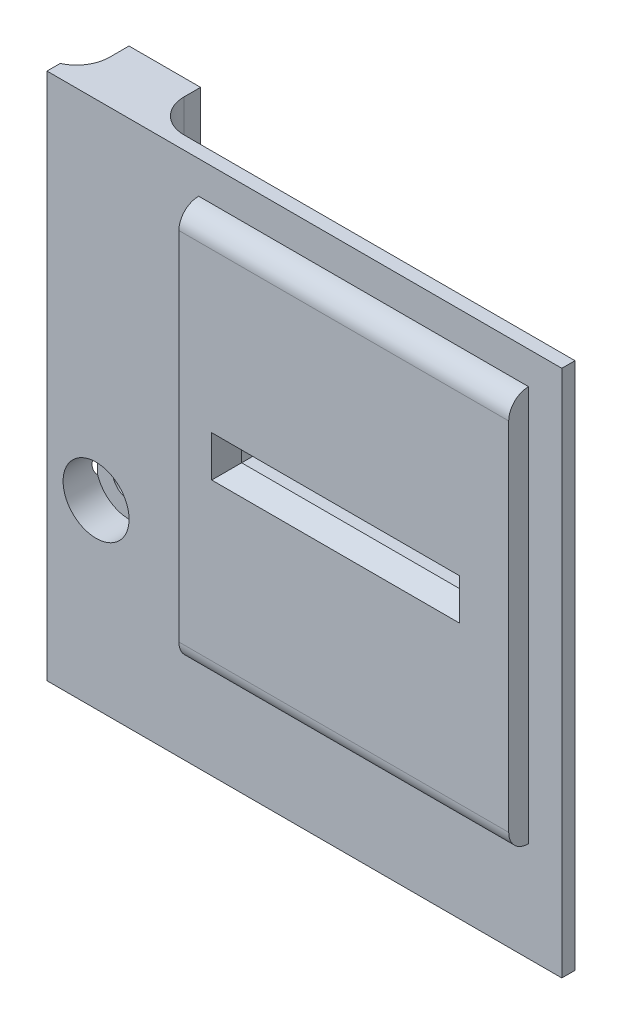
ISO-10303-21;
HEADER;
FILE_DESCRIPTION(('STEP AP214'),'2;1');
FILE_NAME('part.step','',(''),(''),'','','');
FILE_SCHEMA(('AUTOMOTIVE_DESIGN { 1 0 10303 214 1 1 1 1 }'));
ENDSEC;
DATA;
#1=APPLICATION_CONTEXT('core data for automotive mechanical design processes');
#2=APPLICATION_PROTOCOL_DEFINITION('international standard','automotive_design',2000,#1);
#3=PRODUCT_CONTEXT('',#1,'mechanical');
#4=PRODUCT('Part','Part','',(#3));
#5=PRODUCT_RELATED_PRODUCT_CATEGORY('part','',(#4));
#6=PRODUCT_DEFINITION_FORMATION('','',#4);
#7=PRODUCT_DEFINITION_CONTEXT('part definition',#1,'design');
#8=PRODUCT_DEFINITION('design','',#6,#7);
#9=PRODUCT_DEFINITION_SHAPE('','',#8);
#10=(LENGTH_UNIT() NAMED_UNIT(*) SI_UNIT(.MILLI.,.METRE.));
#11=(NAMED_UNIT(*) PLANE_ANGLE_UNIT() SI_UNIT($,.RADIAN.));
#12=(NAMED_UNIT(*) SI_UNIT($,.STERADIAN.) SOLID_ANGLE_UNIT());
#13=UNCERTAINTY_MEASURE_WITH_UNIT(LENGTH_MEASURE(1.E-05),#10,'distance_accuracy_value','');
#14=(GEOMETRIC_REPRESENTATION_CONTEXT(3) GLOBAL_UNCERTAINTY_ASSIGNED_CONTEXT((#13)) GLOBAL_UNIT_ASSIGNED_CONTEXT((#10,
#11,#12)) REPRESENTATION_CONTEXT('',''));
#15=CARTESIAN_POINT('',(0.,0.,0.));
#16=DIRECTION('',(0.,0.,1.));
#17=DIRECTION('',(1.,0.,0.));
#18=AXIS2_PLACEMENT_3D('',#15,#16,#17);
#19=CARTESIAN_POINT('',(0.,0.,2.));
#20=DIRECTION('',(0.,0.,1.));
#21=DIRECTION('',(1.,0.,0.));
#22=AXIS2_PLACEMENT_3D('',#19,#20,#21);
#23=PLANE('',#22);
#24=DIRECTION('',(0.,-1.,0.));
#25=VECTOR('',#24,1.);
#26=CARTESIAN_POINT('',(-65.0546789243204,50.907965965349,2.));
#27=LINE('',#26,#25);
#28=CARTESIAN_POINT('',(-65.0546789243204,50.907965965349,2.));
#29=VERTEX_POINT('',#28);
#30=CARTESIAN_POINT('',(-65.0546789243204,-29.092034034651,2.));
#31=VERTEX_POINT('',#30);
#32=EDGE_CURVE('E227',#29,#31,#27,.T.);
#33=ORIENTED_EDGE('',*,*,#32,.T.);
#34=DIRECTION('',(1.,0.,0.));
#35=VECTOR('',#34,1.);
#36=CARTESIAN_POINT('',(-65.0546789243204,-29.092034034651,2.));
#37=LINE('',#36,#35);
#38=CARTESIAN_POINT('',(12.9453210756796,-29.092034034651,2.));
#39=VERTEX_POINT('',#38);
#40=EDGE_CURVE('E230',#31,#39,#37,.T.);
#41=ORIENTED_EDGE('',*,*,#40,.T.);
#42=DIRECTION('',(0.,1.,0.));
#43=VECTOR('',#42,1.);
#44=CARTESIAN_POINT('',(12.9453210756796,50.907965965349,2.));
#45=LINE('',#44,#43);
#46=CARTESIAN_POINT('',(12.9453210756796,50.907965965349,2.));
#47=VERTEX_POINT('',#46);
#48=EDGE_CURVE('E233',#39,#47,#45,.T.);
#49=ORIENTED_EDGE('',*,*,#48,.T.);
#50=DIRECTION('',(-1.,0.,0.));
#51=VECTOR('',#50,1.);
#52=CARTESIAN_POINT('',(-65.0546789243204,50.907965965349,2.));
#53=LINE('',#52,#51);
#54=EDGE_CURVE('E235',#47,#29,#53,.T.);
#55=ORIENTED_EDGE('',*,*,#54,.T.);
#56=EDGE_LOOP('',(#33,#41,#49,#55));
#57=FACE_BOUND('',#56,.T.);
#58=CARTESIAN_POINT('',(-57.6172989243204,-1.68356138772702,2.));
#59=DIRECTION('',(0.,0.,1.));
#60=DIRECTION('',(1.,0.,0.));
#61=AXIS2_PLACEMENT_3D('',#58,#59,#60);
#62=CIRCLE('',#61,5.);
#63=CARTESIAN_POINT('',(-52.6172989243204,-1.68356138772702,2.));
#64=VERTEX_POINT('',#63);
#65=EDGE_CURVE('E338',#64,#64,#62,.T.);
#66=ORIENTED_EDGE('',*,*,#65,.F.);
#67=EDGE_LOOP('',(#66));
#68=FACE_BOUND('',#67,.T.);
#69=DIRECTION('',(1.,0.,0.));
#70=VECTOR('',#69,1.);
#71=CARTESIAN_POINT('',(-42.072395895616,-14.010394241458,2.));
#72=LINE('',#71,#70);
#73=CARTESIAN_POINT('',(-42.072395895616,-14.010394241458,2.));
#74=VERTEX_POINT('',#73);
#75=CARTESIAN_POINT('',(7.89894329154706,-14.010394241458,2.));
#76=VERTEX_POINT('',#75);
#77=EDGE_CURVE('E325',#74,#76,#72,.T.);
#78=ORIENTED_EDGE('',*,*,#77,.F.);
#79=DIRECTION('',(0.,-1.,0.));
#80=VECTOR('',#79,1.);
#81=CARTESIAN_POINT('',(-42.072395895616,45.9780036597213,2.));
#82=LINE('',#81,#80);
#83=CARTESIAN_POINT('',(-42.072395895616,45.9780036597213,2.));
#84=VERTEX_POINT('',#83);
#85=EDGE_CURVE('E313',#84,#74,#82,.T.);
#86=ORIENTED_EDGE('',*,*,#85,.F.);
#87=DIRECTION('',(-1.,0.,0.));
#88=VECTOR('',#87,1.);
#89=CARTESIAN_POINT('',(-42.072395895616,45.9780036597213,2.));
#90=LINE('',#89,#88);
#91=CARTESIAN_POINT('',(7.89894329154706,45.9780036597213,2.));
#92=VERTEX_POINT('',#91);
#93=EDGE_CURVE('E323',#92,#84,#90,.T.);
#94=ORIENTED_EDGE('',*,*,#93,.F.);
#95=DIRECTION('',(0.,1.,0.));
#96=VECTOR('',#95,1.);
#97=CARTESIAN_POINT('',(7.89894329154706,45.9780036597213,2.));
#98=LINE('',#97,#96);
#99=EDGE_CURVE('E328',#76,#92,#98,.T.);
#100=ORIENTED_EDGE('',*,*,#99,.F.);
#101=EDGE_LOOP('',(#78,#86,#94,#100));
#102=FACE_BOUND('',#101,.T.);
#103=ADVANCED_FACE('F33',(#57,#68,#102),#23,.T.);
#104=CARTESIAN_POINT('',(-57.6172989243204,-1.68356138772702,12.5));
#105=DIRECTION('',(0.,0.,-1.));
#106=DIRECTION('',(-1.,0.,0.));
#107=AXIS2_PLACEMENT_3D('',#104,#105,#106);
#108=CYLINDRICAL_SURFACE('',#107,2.5);
#109=CARTESIAN_POINT('',(-57.6172989243204,-1.68356138772702,-7.5));
#110=DIRECTION('',(0.,0.,-1.));
#111=DIRECTION('',(-1.,0.,0.));
#112=AXIS2_PLACEMENT_3D('',#109,#110,#111);
#113=CIRCLE('',#112,2.5);
#114=CARTESIAN_POINT('',(-60.1172989243204,-1.68356138772702,-7.5));
#115=VERTEX_POINT('',#114);
#116=EDGE_CURVE('E301',#115,#115,#113,.T.);
#117=ORIENTED_EDGE('',*,*,#116,.T.);
#118=EDGE_LOOP('',(#117));
#119=FACE_BOUND('',#118,.T.);
#120=CARTESIAN_POINT('',(-57.6172989243204,-1.68356138772702,-3.));
#121=DIRECTION('',(0.,0.,1.));
#122=DIRECTION('',(1.,0.,0.));
#123=AXIS2_PLACEMENT_3D('',#120,#121,#122);
#124=CIRCLE('',#123,2.5);
#125=CARTESIAN_POINT('',(-55.1172989243204,-1.68356138772702,-3.));
#126=VERTEX_POINT('',#125);
#127=EDGE_CURVE('E337',#126,#126,#124,.F.);
#128=ORIENTED_EDGE('',*,*,#127,.F.);
#129=EDGE_LOOP('',(#128));
#130=FACE_BOUND('',#129,.T.);
#131=ADVANCED_FACE('F286',(#119,#130),#108,.F.);
#132=CARTESIAN_POINT('',(0.,0.,0.));
#133=DIRECTION('',(0.,0.,1.));
#134=DIRECTION('',(1.,0.,0.));
#135=AXIS2_PLACEMENT_3D('',#132,#133,#134);
#136=PLANE('',#135);
#137=DIRECTION('',(-1.,0.,0.));
#138=VECTOR('',#137,1.);
#139=CARTESIAN_POINT('',(-1.11467892432038,14.2516742225141,0.));
#140=LINE('',#139,#138);
#141=CARTESIAN_POINT('',(-1.11467892432038,14.2516742225141,0.));
#142=VERTEX_POINT('',#141);
#143=CARTESIAN_POINT('',(-35.5652250470513,14.2516742225141,0.));
#144=VERTEX_POINT('',#143);
#145=EDGE_CURVE('E355',#142,#144,#140,.T.);
#146=ORIENTED_EDGE('',*,*,#145,.F.);
#147=DIRECTION('',(0.,-1.,0.));
#148=VECTOR('',#147,1.);
#149=CARTESIAN_POINT('',(-1.11467892432038,17.407965965349,0.));
#150=LINE('',#149,#148);
#151=CARTESIAN_POINT('',(-1.11467892432038,17.407965965349,0.));
#152=VERTEX_POINT('',#151);
#153=EDGE_CURVE('E353',#152,#142,#150,.T.);
#154=ORIENTED_EDGE('',*,*,#153,.F.);
#155=DIRECTION('',(1.,0.,0.));
#156=VECTOR('',#155,1.);
#157=CARTESIAN_POINT('',(-1.11467892432038,17.407965965349,0.));
#158=LINE('',#157,#156);
#159=CARTESIAN_POINT('',(-35.5652250470513,17.407965965349,0.));
#160=VERTEX_POINT('',#159);
#161=EDGE_CURVE('E222',#160,#152,#158,.T.);
#162=ORIENTED_EDGE('',*,*,#161,.F.);
#163=DIRECTION('',(0.,1.,0.));
#164=VECTOR('',#163,1.);
#165=CARTESIAN_POINT('',(-35.5652250470513,17.407965965349,0.));
#166=LINE('',#165,#164);
#167=EDGE_CURVE('E211',#144,#160,#166,.T.);
#168=ORIENTED_EDGE('',*,*,#167,.F.);
#169=EDGE_LOOP('',(#146,#154,#162,#168));
#170=FACE_BOUND('',#169,.T.);
#171=DIRECTION('',(1.,0.,0.));
#172=VECTOR('',#171,1.);
#173=CARTESIAN_POINT('',(-65.0546789243204,-29.092034034651,0.));
#174=LINE('',#173,#172);
#175=CARTESIAN_POINT('',(-46.2850653480257,-29.092034034651,0.));
#176=VERTEX_POINT('',#175);
#177=CARTESIAN_POINT('',(12.9453210756796,-29.092034034651,0.));
#178=VERTEX_POINT('',#177);
#179=EDGE_CURVE('E240',#176,#178,#174,.T.);
#180=ORIENTED_EDGE('',*,*,#179,.F.);
#181=DIRECTION('',(0.,-1.,0.));
#182=VECTOR('',#181,1.);
#183=CARTESIAN_POINT('',(-46.2850653480257,50.907965965349,0.));
#184=LINE('',#183,#182);
#185=CARTESIAN_POINT('',(-46.2850653480257,50.907965965349,0.));
#186=VERTEX_POINT('',#185);
#187=EDGE_CURVE('E250',#176,#186,#184,.F.);
#188=ORIENTED_EDGE('',*,*,#187,.T.);
#189=DIRECTION('',(-1.,0.,0.));
#190=VECTOR('',#189,1.);
#191=CARTESIAN_POINT('',(-65.0546789243204,50.907965965349,0.));
#192=LINE('',#191,#190);
#193=CARTESIAN_POINT('',(12.9453210756796,50.907965965349,0.));
#194=VERTEX_POINT('',#193);
#195=EDGE_CURVE('E231',#194,#186,#192,.T.);
#196=ORIENTED_EDGE('',*,*,#195,.F.);
#197=DIRECTION('',(0.,1.,0.));
#198=VECTOR('',#197,1.);
#199=CARTESIAN_POINT('',(12.9453210756796,50.907965965349,0.));
#200=LINE('',#199,#198);
#201=EDGE_CURVE('E243',#178,#194,#200,.T.);
#202=ORIENTED_EDGE('',*,*,#201,.F.);
#203=EDGE_LOOP('',(#180,#188,#196,#202));
#204=FACE_BOUND('',#203,.T.);
#205=ADVANCED_FACE('F362',(#170,#204),#136,.F.);
#206=CARTESIAN_POINT('',(-65.0546789243204,50.907965965349,2.));
#207=DIRECTION('',(1.,0.,0.));
#208=DIRECTION('',(0.,1.,0.));
#209=AXIS2_PLACEMENT_3D('',#206,#207,#208);
#210=PLANE('',#209);
#211=DIRECTION('',(0.,-1.,0.));
#212=VECTOR('',#211,1.);
#213=CARTESIAN_POINT('',(-65.0546789243204,50.907965965349,0.));
#214=LINE('',#213,#212);
#215=CARTESIAN_POINT('',(-65.0546789243204,50.907965965349,0.));
#216=VERTEX_POINT('',#215);
#217=CARTESIAN_POINT('',(-65.0546789243204,-29.092034034651,0.));
#218=VERTEX_POINT('',#217);
#219=EDGE_CURVE('E226',#216,#218,#214,.T.);
#220=ORIENTED_EDGE('',*,*,#219,.T.);
#221=DIRECTION('',(0.,0.,-1.));
#222=VECTOR('',#221,1.);
#223=CARTESIAN_POINT('',(-65.0546789243204,-29.092034034651,2.));
#224=LINE('',#223,#222);
#225=EDGE_CURVE('E295',#31,#218,#224,.T.);
#226=ORIENTED_EDGE('',*,*,#225,.F.);
#227=ORIENTED_EDGE('',*,*,#32,.F.);
#228=DIRECTION('',(0.,0.,-1.));
#229=VECTOR('',#228,1.);
#230=CARTESIAN_POINT('',(-65.0546789243204,50.907965965349,2.));
#231=LINE('',#230,#229);
#232=EDGE_CURVE('E237',#29,#216,#231,.T.);
#233=ORIENTED_EDGE('',*,*,#232,.T.);
#234=EDGE_LOOP('',(#220,#226,#227,#233));
#235=FACE_BOUND('',#234,.T.);
#236=ADVANCED_FACE('F412',(#235),#210,.F.);
#237=CARTESIAN_POINT('',(-65.0546789243204,-29.092034034651,2.));
#238=DIRECTION('',(0.,1.,0.));
#239=DIRECTION('',(0.,0.,1.));
#240=AXIS2_PLACEMENT_3D('',#237,#238,#239);
#241=PLANE('',#240);
#242=ORIENTED_EDGE('',*,*,#225,.T.);
#243=CARTESIAN_POINT('',(-67.1274011553297,-29.092034034651,-4.55014533318222));
#244=DIRECTION('',(0.,1.,0.));
#245=DIRECTION('',(0.,0.,1.));
#246=AXIS2_PLACEMENT_3D('',#243,#244,#245);
#247=CIRCLE('',#246,5.);
#248=CARTESIAN_POINT('',(-62.1274011553297,-29.092034034651,-4.55014533318222));
#249=VERTEX_POINT('',#248);
#250=EDGE_CURVE('E261',#218,#249,#247,.T.);
#251=ORIENTED_EDGE('',*,*,#250,.T.);
#252=DIRECTION('',(0.,0.,1.));
#253=VECTOR('',#252,1.);
#254=CARTESIAN_POINT('',(-62.1274011553297,-29.092034034651,-7.5));
#255=LINE('',#254,#253);
#256=CARTESIAN_POINT('',(-62.1274011553297,-29.092034034651,-7.5));
#257=VERTEX_POINT('',#256);
#258=EDGE_CURVE('E352',#257,#249,#255,.T.);
#259=ORIENTED_EDGE('',*,*,#258,.F.);
#260=DIRECTION('',(-1.,0.,0.));
#261=VECTOR('',#260,1.);
#262=CARTESIAN_POINT('',(-62.1274011553297,-29.092034034651,-7.5));
#263=LINE('',#262,#261);
#264=CARTESIAN_POINT('',(-51.2850653480257,-29.092034034651,-7.5));
#265=VERTEX_POINT('',#264);
#266=EDGE_CURVE('E350',#265,#257,#263,.T.);
#267=ORIENTED_EDGE('',*,*,#266,.F.);
#268=DIRECTION('',(0.,0.,1.));
#269=VECTOR('',#268,1.);
#270=CARTESIAN_POINT('',(-51.2850653480257,-29.092034034651,-7.5));
#271=LINE('',#270,#269);
#272=CARTESIAN_POINT('',(-51.2850653480257,-29.092034034651,-5.));
#273=VERTEX_POINT('',#272);
#274=EDGE_CURVE('E451',#265,#273,#271,.T.);
#275=ORIENTED_EDGE('',*,*,#274,.T.);
#276=CARTESIAN_POINT('',(-46.2850653480257,-29.092034034651,-5.));
#277=DIRECTION('',(0.,1.,0.));
#278=DIRECTION('',(0.,0.,1.));
#279=AXIS2_PLACEMENT_3D('',#276,#277,#278);
#280=CIRCLE('',#279,5.);
#281=EDGE_CURVE('E255',#273,#176,#280,.T.);
#282=ORIENTED_EDGE('',*,*,#281,.T.);
#283=ORIENTED_EDGE('',*,*,#179,.T.);
#284=DIRECTION('',(0.,0.,-1.));
#285=VECTOR('',#284,1.);
#286=CARTESIAN_POINT('',(12.9453210756796,-29.092034034651,2.));
#287=LINE('',#286,#285);
#288=EDGE_CURVE('E487',#39,#178,#287,.T.);
#289=ORIENTED_EDGE('',*,*,#288,.F.);
#290=ORIENTED_EDGE('',*,*,#40,.F.);
#291=EDGE_LOOP('',(#242,#251,#259,#267,#275,#282,#283,#289,#290));
#292=FACE_BOUND('',#291,.T.);
#293=ADVANCED_FACE('F420',(#292),#241,.F.);
#294=CARTESIAN_POINT('',(12.9453210756796,50.907965965349,2.));
#295=DIRECTION('',(-1.,0.,0.));
#296=DIRECTION('',(0.,-1.,0.));
#297=AXIS2_PLACEMENT_3D('',#294,#295,#296);
#298=PLANE('',#297);
#299=ORIENTED_EDGE('',*,*,#201,.T.);
#300=DIRECTION('',(0.,0.,-1.));
#301=VECTOR('',#300,1.);
#302=CARTESIAN_POINT('',(12.9453210756796,50.907965965349,2.));
#303=LINE('',#302,#301);
#304=EDGE_CURVE('E485',#47,#194,#303,.T.);
#305=ORIENTED_EDGE('',*,*,#304,.F.);
#306=ORIENTED_EDGE('',*,*,#48,.F.);
#307=ORIENTED_EDGE('',*,*,#288,.T.);
#308=EDGE_LOOP('',(#299,#305,#306,#307));
#309=FACE_BOUND('',#308,.T.);
#310=ADVANCED_FACE('F416',(#309),#298,.F.);
#311=CARTESIAN_POINT('',(-65.0546789243204,50.907965965349,2.));
#312=DIRECTION('',(0.,-1.,0.));
#313=DIRECTION('',(0.,0.,-1.));
#314=AXIS2_PLACEMENT_3D('',#311,#312,#313);
#315=PLANE('',#314);
#316=ORIENTED_EDGE('',*,*,#195,.T.);
#317=CARTESIAN_POINT('',(-46.2850653480257,50.907965965349,-5.));
#318=DIRECTION('',(0.,-1.,0.));
#319=DIRECTION('',(0.,0.,-1.));
#320=AXIS2_PLACEMENT_3D('',#317,#318,#319);
#321=CIRCLE('',#320,5.);
#322=CARTESIAN_POINT('',(-51.2850653480257,50.907965965349,-5.));
#323=VERTEX_POINT('',#322);
#324=EDGE_CURVE('E257',#186,#323,#321,.T.);
#325=ORIENTED_EDGE('',*,*,#324,.T.);
#326=DIRECTION('',(0.,0.,1.));
#327=VECTOR('',#326,1.);
#328=CARTESIAN_POINT('',(-51.2850653480257,50.907965965349,-7.5));
#329=LINE('',#328,#327);
#330=CARTESIAN_POINT('',(-51.2850653480257,50.907965965349,-7.5));
#331=VERTEX_POINT('',#330);
#332=EDGE_CURVE('E443',#331,#323,#329,.T.);
#333=ORIENTED_EDGE('',*,*,#332,.F.);
#334=DIRECTION('',(1.,0.,0.));
#335=VECTOR('',#334,1.);
#336=CARTESIAN_POINT('',(-62.1274011553297,50.907965965349,-7.5));
#337=LINE('',#336,#335);
#338=CARTESIAN_POINT('',(-62.1274011553297,50.907965965349,-7.5));
#339=VERTEX_POINT('',#338);
#340=EDGE_CURVE('E346',#339,#331,#337,.T.);
#341=ORIENTED_EDGE('',*,*,#340,.F.);
#342=DIRECTION('',(0.,0.,1.));
#343=VECTOR('',#342,1.);
#344=CARTESIAN_POINT('',(-62.1274011553297,50.907965965349,-7.5));
#345=LINE('',#344,#343);
#346=CARTESIAN_POINT('',(-62.1274011553297,50.907965965349,-4.55014533318222));
#347=VERTEX_POINT('',#346);
#348=EDGE_CURVE('E356',#339,#347,#345,.T.);
#349=ORIENTED_EDGE('',*,*,#348,.T.);
#350=CARTESIAN_POINT('',(-67.1274011553297,50.907965965349,-4.55014533318222));
#351=DIRECTION('',(0.,-1.,0.));
#352=DIRECTION('',(0.,0.,-1.));
#353=AXIS2_PLACEMENT_3D('',#350,#351,#352);
#354=CIRCLE('',#353,5.);
#355=EDGE_CURVE('E259',#347,#216,#354,.T.);
#356=ORIENTED_EDGE('',*,*,#355,.T.);
#357=ORIENTED_EDGE('',*,*,#232,.F.);
#358=ORIENTED_EDGE('',*,*,#54,.F.);
#359=ORIENTED_EDGE('',*,*,#304,.T.);
#360=EDGE_LOOP('',(#316,#325,#333,#341,#349,#356,#357,#358,#359));
#361=FACE_BOUND('',#360,.T.);
#362=ADVANCED_FACE('F413',(#361),#315,.F.);
#363=CARTESIAN_POINT('',(-1.11467892432038,17.407965965349,10.));
#364=DIRECTION('',(1.,0.,0.));
#365=DIRECTION('',(0.,0.,-1.));
#366=AXIS2_PLACEMENT_3D('',#363,#364,#365);
#367=PLANE('',#366);
#368=DIRECTION('',(0.,1.,0.));
#369=VECTOR('',#368,1.);
#370=CARTESIAN_POINT('',(-1.11467892432038,0.,2.));
#371=LINE('',#370,#369);
#372=CARTESIAN_POINT('',(-1.11467892432038,14.2516742225141,2.));
#373=VERTEX_POINT('',#372);
#374=CARTESIAN_POINT('',(-1.11467892432038,17.407965965349,2.));
#375=VERTEX_POINT('',#374);
#376=EDGE_CURVE('E207',#373,#375,#371,.T.);
#377=ORIENTED_EDGE('',*,*,#376,.T.);
#378=DIRECTION('',(0.,0.,-1.));
#379=VECTOR('',#378,1.);
#380=CARTESIAN_POINT('',(-1.11467892432038,17.407965965349,10.));
#381=LINE('',#380,#379);
#382=EDGE_CURVE('E206',#375,#152,#381,.T.);
#383=ORIENTED_EDGE('',*,*,#382,.T.);
#384=ORIENTED_EDGE('',*,*,#153,.T.);
#385=DIRECTION('',(0.,0.,-1.));
#386=VECTOR('',#385,1.);
#387=CARTESIAN_POINT('',(-1.11467892432038,14.2516742225141,10.));
#388=LINE('',#387,#386);
#389=EDGE_CURVE('E216',#373,#142,#388,.T.);
#390=ORIENTED_EDGE('',*,*,#389,.F.);
#391=EDGE_LOOP('',(#377,#383,#384,#390));
#392=FACE_BOUND('',#391,.T.);
#393=ADVANCED_FACE('F366',(#392),#367,.F.);
#394=CARTESIAN_POINT('',(-1.11467892432038,17.407965965349,10.));
#395=DIRECTION('',(0.,1.,0.));
#396=DIRECTION('',(0.,0.,1.));
#397=AXIS2_PLACEMENT_3D('',#394,#395,#396);
#398=PLANE('',#397);
#399=DIRECTION('',(-1.,0.,0.));
#400=VECTOR('',#399,1.);
#401=CARTESIAN_POINT('',(0.,17.407965965349,2.));
#402=LINE('',#401,#400);
#403=CARTESIAN_POINT('',(-35.5652250470513,17.407965965349,2.));
#404=VERTEX_POINT('',#403);
#405=EDGE_CURVE('E180',#375,#404,#402,.T.);
#406=ORIENTED_EDGE('',*,*,#405,.T.);
#407=DIRECTION('',(0.,0.,-1.));
#408=VECTOR('',#407,1.);
#409=CARTESIAN_POINT('',(-35.5652250470513,17.407965965349,10.));
#410=LINE('',#409,#408);
#411=EDGE_CURVE('E204',#404,#160,#410,.T.);
#412=ORIENTED_EDGE('',*,*,#411,.T.);
#413=ORIENTED_EDGE('',*,*,#161,.T.);
#414=ORIENTED_EDGE('',*,*,#382,.F.);
#415=EDGE_LOOP('',(#406,#412,#413,#414));
#416=FACE_BOUND('',#415,.T.);
#417=ADVANCED_FACE('F202',(#416),#398,.F.);
#418=CARTESIAN_POINT('',(-35.5652250470513,17.407965965349,10.));
#419=DIRECTION('',(-1.,0.,0.));
#420=DIRECTION('',(0.,0.,1.));
#421=AXIS2_PLACEMENT_3D('',#418,#419,#420);
#422=PLANE('',#421);
#423=DIRECTION('',(0.,-1.,0.));
#424=VECTOR('',#423,1.);
#425=CARTESIAN_POINT('',(-35.5652250470513,0.,2.));
#426=LINE('',#425,#424);
#427=CARTESIAN_POINT('',(-35.5652250470513,14.2516742225141,2.));
#428=VERTEX_POINT('',#427);
#429=EDGE_CURVE('E192',#404,#428,#426,.T.);
#430=ORIENTED_EDGE('',*,*,#429,.T.);
#431=DIRECTION('',(0.,0.,-1.));
#432=VECTOR('',#431,1.);
#433=CARTESIAN_POINT('',(-35.5652250470513,14.2516742225141,10.));
#434=LINE('',#433,#432);
#435=EDGE_CURVE('E213',#428,#144,#434,.T.);
#436=ORIENTED_EDGE('',*,*,#435,.T.);
#437=ORIENTED_EDGE('',*,*,#167,.T.);
#438=ORIENTED_EDGE('',*,*,#411,.F.);
#439=EDGE_LOOP('',(#430,#436,#437,#438));
#440=FACE_BOUND('',#439,.T.);
#441=ADVANCED_FACE('F209',(#440),#422,.F.);
#442=CARTESIAN_POINT('',(-1.11467892432038,14.2516742225141,10.));
#443=DIRECTION('',(0.,-1.,0.));
#444=DIRECTION('',(0.,0.,-1.));
#445=AXIS2_PLACEMENT_3D('',#442,#443,#444);
#446=PLANE('',#445);
#447=DIRECTION('',(1.,0.,0.));
#448=VECTOR('',#447,1.);
#449=CARTESIAN_POINT('',(0.,14.2516742225141,2.));
#450=LINE('',#449,#448);
#451=EDGE_CURVE('E198',#428,#373,#450,.T.);
#452=ORIENTED_EDGE('',*,*,#451,.T.);
#453=ORIENTED_EDGE('',*,*,#389,.T.);
#454=ORIENTED_EDGE('',*,*,#145,.T.);
#455=ORIENTED_EDGE('',*,*,#435,.F.);
#456=EDGE_LOOP('',(#452,#453,#454,#455));
#457=FACE_BOUND('',#456,.T.);
#458=ADVANCED_FACE('F368',(#457),#446,.F.);
#459=CARTESIAN_POINT('',(-62.1274011553297,50.907965965349,-7.5));
#460=DIRECTION('',(1.,0.,0.));
#461=DIRECTION('',(0.,0.,-1.));
#462=AXIS2_PLACEMENT_3D('',#459,#460,#461);
#463=PLANE('',#462);
#464=ORIENTED_EDGE('',*,*,#258,.T.);
#465=DIRECTION('',(0.,1.,0.));
#466=VECTOR('',#465,1.);
#467=CARTESIAN_POINT('',(-62.1274011553297,50.907965965349,-4.55014533318222));
#468=LINE('',#467,#466);
#469=EDGE_CURVE('E252',#249,#347,#468,.T.);
#470=ORIENTED_EDGE('',*,*,#469,.T.);
#471=ORIENTED_EDGE('',*,*,#348,.F.);
#472=DIRECTION('',(0.,1.,0.));
#473=VECTOR('',#472,1.);
#474=CARTESIAN_POINT('',(-62.1274011553297,50.907965965349,-7.5));
#475=LINE('',#474,#473);
#476=EDGE_CURVE('E343',#257,#339,#475,.T.);
#477=ORIENTED_EDGE('',*,*,#476,.F.);
#478=EDGE_LOOP('',(#464,#470,#471,#477));
#479=FACE_BOUND('',#478,.T.);
#480=ADVANCED_FACE('F475',(#479),#463,.F.);
#481=CARTESIAN_POINT('',(-51.2850653480257,50.907965965349,-7.5));
#482=DIRECTION('',(-1.,0.,0.));
#483=DIRECTION('',(0.,0.,1.));
#484=AXIS2_PLACEMENT_3D('',#481,#482,#483);
#485=PLANE('',#484);
#486=ORIENTED_EDGE('',*,*,#332,.T.);
#487=DIRECTION('',(0.,-1.,0.));
#488=VECTOR('',#487,1.);
#489=CARTESIAN_POINT('',(-51.2850653480257,-29.092034034651,-5.));
#490=LINE('',#489,#488);
#491=EDGE_CURVE('E248',#323,#273,#490,.T.);
#492=ORIENTED_EDGE('',*,*,#491,.T.);
#493=ORIENTED_EDGE('',*,*,#274,.F.);
#494=DIRECTION('',(0.,-1.,0.));
#495=VECTOR('',#494,1.);
#496=CARTESIAN_POINT('',(-51.2850653480257,50.907965965349,-7.5));
#497=LINE('',#496,#495);
#498=EDGE_CURVE('E348',#331,#265,#497,.T.);
#499=ORIENTED_EDGE('',*,*,#498,.F.);
#500=EDGE_LOOP('',(#486,#492,#493,#499));
#501=FACE_BOUND('',#500,.T.);
#502=ADVANCED_FACE('F448',(#501),#485,.F.);
#503=CARTESIAN_POINT('',(0.,0.,-7.5));
#504=DIRECTION('',(0.,0.,1.));
#505=DIRECTION('',(1.,0.,0.));
#506=AXIS2_PLACEMENT_3D('',#503,#504,#505);
#507=PLANE('',#506);
#508=ORIENTED_EDGE('',*,*,#116,.F.);
#509=EDGE_LOOP('',(#508));
#510=FACE_BOUND('',#509,.T.);
#511=ORIENTED_EDGE('',*,*,#476,.T.);
#512=ORIENTED_EDGE('',*,*,#340,.T.);
#513=ORIENTED_EDGE('',*,*,#498,.T.);
#514=ORIENTED_EDGE('',*,*,#266,.T.);
#515=EDGE_LOOP('',(#511,#512,#513,#514));
#516=FACE_BOUND('',#515,.T.);
#517=ADVANCED_FACE('F283',(#510,#516),#507,.F.);
#518=CARTESIAN_POINT('',(-57.6172989243204,-1.68356138772702,-3.));
#519=DIRECTION('',(0.,0.,1.));
#520=DIRECTION('',(1.,0.,0.));
#521=AXIS2_PLACEMENT_3D('',#518,#519,#520);
#522=CYLINDRICAL_SURFACE('',#521,5.);
#523=ORIENTED_EDGE('',*,*,#65,.T.);
#524=EDGE_LOOP('',(#523));
#525=FACE_BOUND('',#524,.T.);
#526=CARTESIAN_POINT('',(-57.6172989243204,-1.68356138772702,-3.));
#527=DIRECTION('',(0.,0.,1.));
#528=DIRECTION('',(1.,0.,0.));
#529=AXIS2_PLACEMENT_3D('',#526,#527,#528);
#530=CIRCLE('',#529,5.);
#531=CARTESIAN_POINT('',(-62.373765762705,-3.22499682761656,-3.));
#532=VERTEX_POINT('',#531);
#533=CARTESIAN_POINT('',(-62.373765762705,-0.142125947837477,-3.));
#534=VERTEX_POINT('',#533);
#535=EDGE_CURVE('E335',#532,#534,#530,.T.);
#536=ORIENTED_EDGE('',*,*,#535,.F.);
#537=CARTESIAN_POINT('',(-62.5576802803679,-2.45338737898654,-2.52094570649607));
#538=CARTESIAN_POINT('',(-62.5488146131724,-2.51030941925394,-2.5409257725188));
#539=CARTESIAN_POINT('',(-62.5390842208783,-2.56625363982438,-2.56317745194624));
#540=CARTESIAN_POINT('',(-62.5181578148006,-2.67587878214411,-2.61220747861622));
#541=CARTESIAN_POINT('',(-62.5069609009303,-2.72955828693888,-2.63898860880204));
#542=CARTESIAN_POINT('',(-62.4720587193651,-2.88452982840726,-2.72489379637666));
#543=CARTESIAN_POINT('',(-62.4466628554677,-2.98206905695101,-2.79038908061417));
#544=CARTESIAN_POINT('',(-62.4127656179743,-3.09928439741463,-2.88499466856324));
#545=CARTESIAN_POINT('',(-62.4050395622498,-3.12517388110652,-2.90701564814821));
#546=CARTESIAN_POINT('',(-62.3894663820054,-3.17591500933816,-2.95247377838481));
#547=CARTESIAN_POINT('',(-62.3816188223305,-3.20076005081301,-2.97591815074769));
#548=CARTESIAN_POINT('',(-62.373765762705,-3.22499682761656,-3.));
#549=B_SPLINE_CURVE_WITH_KNOTS('',3,(#537,#538,#539,#540,#541,#542,#543,#544,#545,#546,#547,
#548),.UNSPECIFIED.,.F.,.F.,(4,2,2,2,2,4),(0.,0.182781015258105,0.365674743849261,
0.724112827443639,0.828653013964979,0.933776993035741),.UNSPECIFIED.);
#550=CARTESIAN_POINT('',(-62.5188252181692,-2.67100252050903,-2.61080837653259));
#551=VERTEX_POINT('',#550);
#552=EDGE_CURVE('E271',#551,#532,#549,.T.);
#553=ORIENTED_EDGE('',*,*,#552,.F.);
#554=CARTESIAN_POINT('',(-62.6172989243204,-1.68356138772702,-2.39167877892535));
#555=CARTESIAN_POINT('',(-62.6172940265331,-1.8033519609868,-2.39168103058232));
#556=CARTESIAN_POINT('',(-62.6129519585424,-1.92329865006776,-2.4006900886681));
#557=CARTESIAN_POINT('',(-62.5959655487764,-2.16002767963939,-2.43674143484257));
#558=CARTESIAN_POINT('',(-62.5833040095883,-2.27680294257226,-2.46382107895992));
#559=CARTESIAN_POINT('',(-62.5509091375083,-2.50369060640816,-2.53587776302536));
#560=CARTESIAN_POINT('',(-62.5311761174117,-2.61380330176711,-2.58085401135639));
#561=CARTESIAN_POINT('',(-62.4866786346236,-2.8240402059949,-2.68814446628817));
#562=CARTESIAN_POINT('',(-62.4619173652839,-2.92417069451014,-2.75044767807587));
#563=CARTESIAN_POINT('',(-62.4103277002646,-3.11048972030634,-2.89041806083103));
#564=CARTESIAN_POINT('',(-62.3835274238016,-3.1968300481087,-2.96789348933481));
#565=CARTESIAN_POINT('',(-62.3304868586432,-3.35473366358499,-3.13683983342174));
#566=CARTESIAN_POINT('',(-62.3042465956866,-3.42629627336758,-3.22831139070781));
#567=CARTESIAN_POINT('',(-62.2554077622984,-3.55238035819497,-3.42165119813994));
#568=CARTESIAN_POINT('',(-62.2327717795913,-3.60708329708231,-3.52339186965452));
#569=CARTESIAN_POINT('',(-62.1930756830464,-3.69970070235024,-3.73525643295517));
#570=CARTESIAN_POINT('',(-62.1760161779178,-3.737613336119,-3.84538123830795));
#571=CARTESIAN_POINT('',(-62.1489392777444,-3.79669062316963,-4.07247816861621));
#572=CARTESIAN_POINT('',(-62.1390205967406,-3.81762099844154,-4.18952293852833));
#573=CARTESIAN_POINT('',(-62.1275465950866,-3.84176572377151,-4.42583555530962));
#574=CARTESIAN_POINT('',(-62.1259924045013,-3.84497768002558,-4.54510370037856));
#575=CARTESIAN_POINT('',(-62.1314446733655,-3.83356856418504,-4.78473594700751));
#576=CARTESIAN_POINT('',(-62.1386046296898,-3.81862774487557,-4.9050815385965));
#577=CARTESIAN_POINT('',(-62.1610495329806,-3.77043226758576,-5.14126692274503));
#578=CARTESIAN_POINT('',(-62.1763341014118,-3.73717846282679,-5.25710692495557));
#579=CARTESIAN_POINT('',(-62.213423869332,-3.65275965028094,-5.48052923718456));
#580=CARTESIAN_POINT('',(-62.235207905426,-3.60165268459566,-5.58813694552715));
#581=CARTESIAN_POINT('',(-62.2830140788322,-3.48223251485536,-5.79228607305305));
#582=CARTESIAN_POINT('',(-62.3090354049638,-3.41392260274144,-5.88882960433058));
#583=CARTESIAN_POINT('',(-62.3619294845195,-3.26303105482428,-6.06629255980443));
#584=CARTESIAN_POINT('',(-62.3887750343707,-3.18076007665789,-6.14748439333212));
#585=CARTESIAN_POINT('',(-62.4409230835056,-3.00310741991809,-6.29457391224616));
#586=CARTESIAN_POINT('',(-62.4662256104294,-2.90772597629113,-6.3604718716499));
#587=CARTESIAN_POINT('',(-62.5124589644458,-2.70723454887274,-6.47527588893464));
#588=CARTESIAN_POINT('',(-62.5334196898698,-2.60219881832034,-6.52429980671164));
#589=CARTESIAN_POINT('',(-62.5691105726704,-2.38477267689465,-6.60537249718786));
#590=CARTESIAN_POINT('',(-62.5838398695619,-2.27238125276164,-6.63741892565494));
#591=CARTESIAN_POINT('',(-62.6058439976301,-2.04145469258517,-6.68467562703112));
#592=CARTESIAN_POINT('',(-62.6129915444115,-1.92284869947603,-6.69959875754551));
#593=CARTESIAN_POINT('',(-62.6187198596487,-1.6845251132875,-6.71158862462828));
#594=CARTESIAN_POINT('',(-62.6172996243882,-1.56480739160938,-6.7086532690733));
#595=CARTESIAN_POINT('',(-62.6059341951745,-1.32570790579362,-6.68474473787925));
#596=CARTESIAN_POINT('',(-62.5958573237835,-1.20636005479238,-6.66349293139765));
#597=CARTESIAN_POINT('',(-62.5679942781727,-0.973362239779102,-6.60268482279142));
#598=CARTESIAN_POINT('',(-62.5502087869776,-0.859711771943758,-6.56313014237774));
#599=CARTESIAN_POINT('',(-62.5089147127937,-0.642284657944554,-6.46647237035237));
#600=CARTESIAN_POINT('',(-62.4854495323602,-0.53844106263883,-6.40950153849391));
#601=CARTESIAN_POINT('',(-62.4352317351457,-0.342763774073835,-6.27885049296624));
#602=CARTESIAN_POINT('',(-62.4084797105366,-0.250927923584224,-6.20517328717225));
#603=CARTESIAN_POINT('',(-62.3551677140266,-0.0835035698023609,-6.04440025172374));
#604=CARTESIAN_POINT('',(-62.3286145385964,-0.00762776266382372,-5.95760108363382));
#605=CARTESIAN_POINT('',(-62.2779923370934,0.128405042782947,-5.77181963809187));
#606=CARTESIAN_POINT('',(-62.2539233617197,0.188561720323717,-5.67283711208462));
#607=CARTESIAN_POINT('',(-62.2108168226092,0.291973545639211,-5.46575767377169));
#608=CARTESIAN_POINT('',(-62.1917660272453,0.335273287975498,-5.35768574222449));
#609=CARTESIAN_POINT('',(-62.1604809203403,0.404728834344806,-5.13522737171643));
#610=CARTESIAN_POINT('',(-62.148247608513,0.430882124126286,-5.02084000936425));
#611=CARTESIAN_POINT('',(-62.1315975279524,0.466206855245798,-4.78672280839803));
#612=CARTESIAN_POINT('',(-62.1273307843578,0.475052506665176,-4.66693312019397));
#613=CARTESIAN_POINT('',(-62.1274733164752,0.474754086176757,-4.42737389344811));
#614=CARTESIAN_POINT('',(-62.1318833973557,0.465608344752473,-4.30760435780779));
#615=CARTESIAN_POINT('',(-62.1490708035757,0.429127249260881,-4.06994434441638));
#616=CARTESIAN_POINT('',(-62.1619509930645,0.401568210498835,-3.9520954585746));
#617=CARTESIAN_POINT('',(-62.1948916676509,0.328216336755123,-3.72327599334032));
#618=CARTESIAN_POINT('',(-62.2149513391257,0.282425567838322,-3.61230463621538));
#619=CARTESIAN_POINT('',(-62.2598919689492,0.173783277893596,-3.40174464343777));
#620=CARTESIAN_POINT('',(-62.2847162343729,0.111129192852703,-3.30204214086551));
#621=CARTESIAN_POINT('',(-62.3366577280868,-0.0302910925426598,-3.1155151707564));
#622=CARTESIAN_POINT('',(-62.3637743814187,-0.109053259790731,-3.02868748901907));
#623=CARTESIAN_POINT('',(-62.4168130076581,-0.279128884777993,-2.87171984648314));
#624=CARTESIAN_POINT('',(-62.4427479136608,-0.370173175972122,-2.80129222146437));
#625=CARTESIAN_POINT('',(-62.4912552034796,-0.563528668799912,-2.67647136721865));
#626=CARTESIAN_POINT('',(-62.5138257999456,-0.66584580949504,-2.62208664615972));
#627=CARTESIAN_POINT('',(-62.5533508367695,-0.879082000002791,-2.53009883463595));
#628=CARTESIAN_POINT('',(-62.5702896610512,-0.990023932631935,-2.49254230778641));
#629=CARTESIAN_POINT('',(-62.5967914005435,-1.21702238694523,-2.43482103537691));
#630=CARTESIAN_POINT('',(-62.6063685119163,-1.33306860621396,-2.41462280753534));
#631=CARTESIAN_POINT('',(-62.6136564470008,-1.4887950958217,-2.39930445235817));
#632=CARTESIAN_POINT('',(-62.615020073818,-1.52767649441275,-2.39644578623141));
#633=CARTESIAN_POINT('',(-62.6168421098832,-1.6055535386666,-2.39263258313137));
#634=CARTESIAN_POINT('',(-62.6173005193832,-1.64454918429758,-2.39167804562808));
#635=CARTESIAN_POINT('',(-62.6172989243204,-1.68356138772702,-2.39167877892535));
#636=B_SPLINE_CURVE_WITH_KNOTS('',3,(#554,#555,#556,#557,#558,#559,#560,#561,#562,#563,#564,
#565,#566,#567,#568,#569,#570,#571,#572,#573,#574,#575,#576,#577,#578,#579,#580,#581,#582,#583,
#584,#585,#586,#587,#588,#589,#590,#591,#592,#593,#594,#595,#596,#597,#598,#599,#600,#601,#602,
#603,#604,#605,#606,#607,#608,#609,#610,#611,#612,#613,#614,#615,#616,#617,#618,#619,#620,#621,
#622,#623,#624,#625,#626,#627,#628,#629,#630,#631,#632,#633,#634,#635),.UNSPECIFIED.,.T.,.F.,(4,
2,2,2,2,2,2,2,2,2,2,2,2,2,2,2,2,2,2,2,2,2,2,2,2,2,2,2,2,2,2,2,2,2,2,2,2,2,2,2,4),(0.,
0.359226567763338,0.719198048901381,1.07915360925939,1.43888127917631,1.79432629816962,
2.14978761870596,2.50127744290169,2.85280562171629,3.20910456187046,3.56545163774949,
3.92816753532986,4.29086653502211,4.6523971789083,5.01385869309855,5.36813565654418,
5.72240627198754,6.07414966479615,6.42594161327627,6.78355034077157,7.14120096297035,
7.50439018475508,7.86754723262019,8.22801220230132,8.58841232404065,8.94163047689549,
9.29485583702245,9.64714029400798,9.9994763962975,10.3583832086702,10.7173233274752,
11.0807051069094,11.4440457187345,11.803304630888,12.162473702461,12.5147664057729,
12.867245608917,13.2206941886148,13.5734594641272,13.6904488353129,13.8074381739352),.UNSPECIFIED.);
#637=CARTESIAN_POINT('',(-62.5188252181692,-0.696120254945131,-2.61080837653282));
#638=VERTEX_POINT('',#637);
#639=EDGE_CURVE('E296',#638,#551,#636,.T.);
#640=ORIENTED_EDGE('',*,*,#639,.F.);
#641=CARTESIAN_POINT('',(-62.373765762705,-0.142125947837481,-3.));
#642=CARTESIAN_POINT('',(-62.4003749445037,-0.224245427992226,-2.9184101285464));
#643=CARTESIAN_POINT('',(-62.4269821132291,-0.313640604213487,-2.84396477522987));
#644=CARTESIAN_POINT('',(-62.4773246514638,-0.50461389266099,-2.7111554789444));
#645=CARTESIAN_POINT('',(-62.5010534781375,-0.606218753534016,-2.65282780290356));
#646=CARTESIAN_POINT('',(-62.5430616870783,-0.818387590935663,-2.55346205562271));
#647=CARTESIAN_POINT('',(-62.5613499137464,-0.928936651170597,-2.51239587819337));
#648=CARTESIAN_POINT('',(-62.5906959921293,-1.15591312916174,-2.44786751426295));
#649=CARTESIAN_POINT('',(-62.6017563405977,-1.27233850205444,-2.4243992484346));
#650=CARTESIAN_POINT('',(-62.6156672137984,-1.50895831263359,-2.3950287343337));
#651=CARTESIAN_POINT('',(-62.6184410461691,-1.62917761505565,-2.38929056288449));
#652=CARTESIAN_POINT('',(-62.6152976963331,-1.86902294445739,-2.39586254961292));
#653=CARTESIAN_POINT('',(-62.609379343096,-1.98864888931998,-2.40817513962854));
#654=CARTESIAN_POINT('',(-62.589305441935,-2.22521650037763,-2.451038381104));
#655=CARTESIAN_POINT('',(-62.5750627701539,-2.34211596620662,-2.48178202432854));
#656=CARTESIAN_POINT('',(-62.5397072408141,-2.5684438965362,-2.56143955359944));
#657=CARTESIAN_POINT('',(-62.5185953845453,-2.67787344708155,-2.61035079158523));
#658=CARTESIAN_POINT('',(-62.4720414882796,-2.8846317874621,-2.72493789752813));
#659=CARTESIAN_POINT('',(-62.446659495971,-2.98209974886044,-2.79038686660111));
#660=CARTESIAN_POINT('',(-62.3941123852704,-3.16376742840871,-2.93706655484994));
#661=CARTESIAN_POINT('',(-62.3669475279696,-3.24796908322431,-3.01829496660977));
#662=CARTESIAN_POINT('',(-62.3142898961249,-3.39955032594323,-3.19290263526566));
#663=CARTESIAN_POINT('',(-62.2887757671523,-3.46720659226593,-3.28603558689825));
#664=CARTESIAN_POINT('',(-62.2415544063036,-3.58629117059079,-3.48302329107914));
#665=CARTESIAN_POINT('',(-62.2198474469208,-3.63771832122535,-3.58687881023688));
#666=CARTESIAN_POINT('',(-62.1823449755772,-3.72380176501203,-3.80283342851426));
#667=CARTESIAN_POINT('',(-62.1665749656052,-3.75838589191648,-3.91496567036109));
#668=CARTESIAN_POINT('',(-62.1425975092047,-3.81017656116239,-4.14395706440143));
#669=CARTESIAN_POINT('',(-62.1343912069303,-3.82738047445519,-4.26081692894736));
#670=CARTESIAN_POINT('',(-62.1262276329864,-3.84450075050631,-4.4984427833624));
#671=CARTESIAN_POINT('',(-62.1264389019925,-3.84406389903298,-4.61924012681102));
#672=CARTESIAN_POINT('',(-62.1355109885236,-3.82502530065421,-4.85907237685705));
#673=CARTESIAN_POINT('',(-62.1443721980476,-3.80642273051267,-4.97810720333233));
#674=CARTESIAN_POINT('',(-62.1699732431053,-3.75094867972711,-5.2118246079634));
#675=CARTESIAN_POINT('',(-62.1867653150455,-3.71395598683028,-5.3264727994949));
#676=CARTESIAN_POINT('',(-62.2265293501331,-3.62198585664655,-5.54715575477305));
#677=CARTESIAN_POINT('',(-62.2495002605134,-3.56701148278194,-5.6531919818458));
#678=CARTESIAN_POINT('',(-62.2987555628084,-3.44095968026294,-5.85187674078854));
#679=CARTESIAN_POINT('',(-62.3249808451206,-3.37015491507548,-5.94471285673419));
#680=CARTESIAN_POINT('',(-62.3781964941025,-3.213488097436,-6.11639870949944));
#681=CARTESIAN_POINT('',(-62.4051867769212,-3.12762768990741,-6.19524997236093));
#682=CARTESIAN_POINT('',(-62.4565950837332,-2.9445515918235,-6.33595421117155));
#683=CARTESIAN_POINT('',(-62.4810467654923,-2.84753474175692,-6.39805400252959));
#684=CARTESIAN_POINT('',(-62.5253377284588,-2.64377864712236,-6.50575712889196));
#685=CARTESIAN_POINT('',(-62.5451765629974,-2.53703846242125,-6.55135886660303));
#686=CARTESIAN_POINT('',(-62.5784239136398,-2.31589313283734,-6.62583667701963));
#687=CARTESIAN_POINT('',(-62.5917757148513,-2.2014300095406,-6.65456567367762));
#688=CARTESIAN_POINT('',(-62.6105170864574,-1.96884737837253,-6.69449794383708));
#689=CARTESIAN_POINT('',(-62.6159054778504,-1.85072733172758,-6.70569862224444));
#690=CARTESIAN_POINT('',(-62.6182384363249,-1.61170404042578,-6.71057654965502));
#691=CARTESIAN_POINT('',(-62.6150144073342,-1.4907918429319,-6.70390390494525));
#692=CARTESIAN_POINT('',(-62.6000691849644,-1.25190774214084,-6.67230601906355));
#693=CARTESIAN_POINT('',(-62.5883479270882,-1.13393586116876,-6.64738063934677));
#694=CARTESIAN_POINT('',(-62.5575243824388,-0.904037318035193,-6.57933635021033));
#695=CARTESIAN_POINT('',(-62.5384039307342,-0.792126312095904,-6.53617264176111));
#696=CARTESIAN_POINT('',(-62.4947688764164,-0.578016548620578,-6.43213422243489));
#697=CARTESIAN_POINT('',(-62.4702552910588,-0.475815964698296,-6.37126285088937));
#698=CARTESIAN_POINT('',(-62.4189721282506,-0.285902725245564,-6.23416826209345));
#699=CARTESIAN_POINT('',(-62.3922520406772,-0.197959180665926,-6.15824634579132));
#700=CARTESIAN_POINT('',(-62.3390590022757,-0.0366823893576894,-5.99214498723862));
#701=CARTESIAN_POINT('',(-62.3125860346224,0.0366518590757307,-5.9019665232672));
#702=CARTESIAN_POINT('',(-62.2630384830035,0.166270327848928,-5.71099584234115));
#703=CARTESIAN_POINT('',(-62.2399258223686,0.222754732633679,-5.61034913548711));
#704=CARTESIAN_POINT('',(-62.1990551230641,0.319001082518425,-5.40034748945009));
#705=CARTESIAN_POINT('',(-62.1812977575025,0.358760925752889,-5.2909914577722));
#706=CARTESIAN_POINT('',(-62.1526852136432,0.421548132930414,-5.06522337590556));
#707=CARTESIAN_POINT('',(-62.1419191367542,0.444360009011079,-4.94874018325936));
#708=CARTESIAN_POINT('',(-62.1286688913941,0.472310101522188,-4.71321333683357));
#709=CARTESIAN_POINT('',(-62.1261852081774,0.47744728241674,-4.59416953344248));
#710=CARTESIAN_POINT('',(-62.1297651133875,0.4699634824933,-4.35458417819245));
#711=CARTESIAN_POINT('',(-62.1359856145541,0.457016501016344,-4.23405497370748));
#712=CARTESIAN_POINT('',(-62.1566611661853,0.412811223654197,-3.99706528311676));
#713=CARTESIAN_POINT('',(-62.1711197583589,0.381545051843475,-3.88060656986133));
#714=CARTESIAN_POINT('',(-62.2067989605652,0.300984438926937,-3.65534062140471));
#715=CARTESIAN_POINT('',(-62.2280127187351,0.251708258182399,-3.54652576884674));
#716=CARTESIAN_POINT('',(-62.2749375620059,0.135851826561196,-3.33985837961843));
#717=CARTESIAN_POINT('',(-62.3006379314743,0.069312625902094,-3.24198061478304));
#718=CARTESIAN_POINT('',(-62.3425133793106,-0.0481880589011196,-3.0982886184113));
#719=CARTESIAN_POINT('',(-62.358139918107,-0.0939025095866302,-3.04791243345092));
#720=CARTESIAN_POINT('',(-62.373765762705,-0.142125947837481,-3.));
#721=B_SPLINE_CURVE_WITH_KNOTS('',3,(#641,#642,#643,#644,#645,#646,#647,#648,#649,#650,#651,
#652,#653,#654,#655,#656,#657,#658,#659,#660,#661,#662,#663,#664,#665,#666,#667,#668,#669,#670,
#671,#672,#673,#674,#675,#676,#677,#678,#679,#680,#681,#682,#683,#684,#685,#686,#687,#688,#689,
#690,#691,#692,#693,#694,#695,#696,#697,#698,#699,#700,#701,#702,#703,#704,#705,#706,#707,#708,
#709,#710,#711,#712,#713,#714,#715,#716,#717,#718,#719,#720),.UNSPECIFIED.,.T.,.F.,(4,2,2,2,2,2,
2,2,2,2,2,2,2,2,2,2,2,2,2,2,2,2,2,2,2,2,2,2,2,2,2,2,2,2,2,2,2,2,2,4),(0.,0.356117465506472,
0.713029836107548,1.06935878839527,1.4255645874585,1.78505704101157,2.14459793062329,
2.50797098963958,2.87129110512998,3.22987410705474,3.58840471307473,3.94045152884617,
4.2925235316398,4.64609104660935,4.99971203658811,5.36041688843489,5.72113808750355,
6.08426902472647,6.44733812988177,6.80457900255902,7.16178086871982,7.51338995250625,
7.86503306895065,8.21969755729973,8.57441454929848,8.93612608617591,9.29784036860327,
9.66044834709913,10.0229879888451,10.3788936303297,10.7347748602894,11.086242229069,
11.4377537554542,11.793661543471,12.1495901832768,12.5120185510566,12.874602851249,
13.2368205421737,13.5981846765881,13.8073093395248),.UNSPECIFIED.);
#722=EDGE_CURVE('E264',#534,#638,#721,.T.);
#723=ORIENTED_EDGE('',*,*,#722,.F.);
#724=EDGE_LOOP('',(#536,#553,#640,#723));
#725=FACE_BOUND('',#724,.T.);
#726=ADVANCED_FACE('F277',(#525,#725),#522,.F.);
#727=CARTESIAN_POINT('',(-57.6172989243204,-1.68356138772702,-3.));
#728=DIRECTION('',(0.,0.,1.));
#729=DIRECTION('',(1.,0.,0.));
#730=AXIS2_PLACEMENT_3D('',#727,#728,#729);
#731=PLANE('',#730);
#732=ORIENTED_EDGE('',*,*,#127,.T.);
#733=EDGE_LOOP('',(#732));
#734=FACE_BOUND('',#733,.T.);
#735=DIRECTION('',(0.,1.,0.));
#736=VECTOR('',#735,1.);
#737=CARTESIAN_POINT('',(-62.373765762705,-1.68356138772702,-3.));
#738=LINE('',#737,#736);
#739=EDGE_CURVE('E272',#534,#532,#738,.F.);
#740=ORIENTED_EDGE('',*,*,#739,.T.);
#741=ORIENTED_EDGE('',*,*,#535,.T.);
#742=EDGE_LOOP('',(#740,#741));
#743=FACE_BOUND('',#742,.T.);
#744=ADVANCED_FACE('F282',(#734,#743),#731,.T.);
#745=CARTESIAN_POINT('',(-46.2850653480257,50.907965965349,-5.));
#746=DIRECTION('',(0.,1.,0.));
#747=DIRECTION('',(0.,0.,1.));
#748=AXIS2_PLACEMENT_3D('',#745,#746,#747);
#749=CYLINDRICAL_SURFACE('',#748,5.);
#750=ORIENTED_EDGE('',*,*,#324,.F.);
#751=ORIENTED_EDGE('',*,*,#187,.F.);
#752=ORIENTED_EDGE('',*,*,#281,.F.);
#753=ORIENTED_EDGE('',*,*,#491,.F.);
#754=EDGE_LOOP('',(#750,#751,#752,#753));
#755=FACE_BOUND('',#754,.T.);
#756=ADVANCED_FACE('F427',(#755),#749,.F.);
#757=CARTESIAN_POINT('',(-67.1274011553297,0.,-4.55014533318222));
#758=DIRECTION('',(0.,1.,0.));
#759=DIRECTION('',(-1.,0.,0.));
#760=AXIS2_PLACEMENT_3D('',#757,#758,#759);
#761=CYLINDRICAL_SURFACE('',#760,5.);
#762=ORIENTED_EDGE('',*,*,#250,.F.);
#763=ORIENTED_EDGE('',*,*,#219,.F.);
#764=ORIENTED_EDGE('',*,*,#355,.F.);
#765=ORIENTED_EDGE('',*,*,#469,.F.);
#766=EDGE_LOOP('',(#762,#763,#764,#765));
#767=FACE_BOUND('',#766,.T.);
#768=ORIENTED_EDGE('',*,*,#722,.T.);
#769=ORIENTED_EDGE('',*,*,#639,.T.);
#770=ORIENTED_EDGE('',*,*,#552,.T.);
#771=ORIENTED_EDGE('',*,*,#739,.F.);
#772=EDGE_LOOP('',(#768,#769,#770,#771));
#773=FACE_BOUND('',#772,.T.);
#774=ADVANCED_FACE('F274',(#767,#773),#761,.F.);
#775=CARTESIAN_POINT('',(-42.072395895616,45.9780036597213,5.));
#776=DIRECTION('',(1.,0.,0.));
#777=DIRECTION('',(0.,0.,-1.));
#778=AXIS2_PLACEMENT_3D('',#775,#776,#777);
#779=PLANE('',#778);
#780=ORIENTED_EDGE('',*,*,#85,.T.);
#781=CARTESIAN_POINT('',(-42.072395895616,-11.010394241458,2.));
#782=DIRECTION('',(1.,0.,0.));
#783=DIRECTION('',(0.,0.,-1.));
#784=AXIS2_PLACEMENT_3D('',#781,#782,#783);
#785=CIRCLE('',#784,3.);
#786=CARTESIAN_POINT('',(-42.072395895616,-11.010394241458,5.));
#787=VERTEX_POINT('',#786);
#788=EDGE_CURVE('E11',#74,#787,#785,.F.);
#789=ORIENTED_EDGE('',*,*,#788,.T.);
#790=DIRECTION('',(0.,-1.,0.));
#791=VECTOR('',#790,1.);
#792=CARTESIAN_POINT('',(-42.072395895616,45.9780036597213,5.));
#793=LINE('',#792,#791);
#794=CARTESIAN_POINT('',(-42.072395895616,42.9780036597213,5.));
#795=VERTEX_POINT('',#794);
#796=EDGE_CURVE('E316',#795,#787,#793,.T.);
#797=ORIENTED_EDGE('',*,*,#796,.F.);
#798=CARTESIAN_POINT('',(-42.072395895616,42.9780036597213,2.));
#799=DIRECTION('',(1.,0.,0.));
#800=DIRECTION('',(0.,0.,-1.));
#801=AXIS2_PLACEMENT_3D('',#798,#799,#800);
#802=CIRCLE('',#801,3.);
#803=EDGE_CURVE('E41',#795,#84,#802,.F.);
#804=ORIENTED_EDGE('',*,*,#803,.T.);
#805=EDGE_LOOP('',(#780,#789,#797,#804));
#806=FACE_BOUND('',#805,.T.);
#807=ADVANCED_FACE('F312',(#806),#779,.F.);
#808=CARTESIAN_POINT('',(7.89894329154706,45.9780036597213,5.));
#809=DIRECTION('',(-1.,0.,0.));
#810=DIRECTION('',(0.,0.,1.));
#811=AXIS2_PLACEMENT_3D('',#808,#809,#810);
#812=PLANE('',#811);
#813=DIRECTION('',(0.,1.,0.));
#814=VECTOR('',#813,1.);
#815=CARTESIAN_POINT('',(7.89894329154706,45.9780036597213,5.));
#816=LINE('',#815,#814);
#817=CARTESIAN_POINT('',(7.89894329154706,-11.010394241458,5.));
#818=VERTEX_POINT('',#817);
#819=CARTESIAN_POINT('',(7.89894329154706,42.9780036597213,5.));
#820=VERTEX_POINT('',#819);
#821=EDGE_CURVE('E330',#818,#820,#816,.T.);
#822=ORIENTED_EDGE('',*,*,#821,.F.);
#823=CARTESIAN_POINT('',(7.89894329154706,-11.010394241458,2.));
#824=DIRECTION('',(-1.,0.,0.));
#825=DIRECTION('',(0.,0.,1.));
#826=AXIS2_PLACEMENT_3D('',#823,#824,#825);
#827=CIRCLE('',#826,3.);
#828=EDGE_CURVE('E308',#818,#76,#827,.F.);
#829=ORIENTED_EDGE('',*,*,#828,.T.);
#830=ORIENTED_EDGE('',*,*,#99,.T.);
#831=CARTESIAN_POINT('',(7.89894329154706,42.9780036597213,2.));
#832=DIRECTION('',(-1.,0.,0.));
#833=DIRECTION('',(0.,0.,1.));
#834=AXIS2_PLACEMENT_3D('',#831,#832,#833);
#835=CIRCLE('',#834,3.);
#836=EDGE_CURVE('E56',#92,#820,#835,.F.);
#837=ORIENTED_EDGE('',*,*,#836,.T.);
#838=EDGE_LOOP('',(#822,#829,#830,#837));
#839=FACE_BOUND('',#838,.T.);
#840=ADVANCED_FACE('F390',(#839),#812,.F.);
#841=CARTESIAN_POINT('',(0.,0.,5.));
#842=DIRECTION('',(0.,0.,1.));
#843=DIRECTION('',(1.,0.,0.));
#844=AXIS2_PLACEMENT_3D('',#841,#842,#843);
#845=PLANE('',#844);
#846=DIRECTION('',(0.,1.,0.));
#847=VECTOR('',#846,1.);
#848=CARTESIAN_POINT('',(-37.0938013955346,17.407965965349,5.));
#849=LINE('',#848,#847);
#850=CARTESIAN_POINT('',(-37.0938013955346,12.7230978740308,5.));
#851=VERTEX_POINT('',#850);
#852=CARTESIAN_POINT('',(-37.0938013955346,18.9365423138323,5.));
#853=VERTEX_POINT('',#852);
#854=EDGE_CURVE('E380',#851,#853,#849,.T.);
#855=ORIENTED_EDGE('',*,*,#854,.T.);
#856=DIRECTION('',(1.,0.,0.));
#857=VECTOR('',#856,1.);
#858=CARTESIAN_POINT('',(-35.5652250470513,18.9365423138323,5.));
#859=LINE('',#858,#857);
#860=CARTESIAN_POINT('',(0.41389742416291,18.9365423138323,5.));
#861=VERTEX_POINT('',#860);
#862=EDGE_CURVE('E183',#853,#861,#859,.T.);
#863=ORIENTED_EDGE('',*,*,#862,.T.);
#864=DIRECTION('',(0.,-1.,0.));
#865=VECTOR('',#864,1.);
#866=CARTESIAN_POINT('',(0.41389742416291,17.407965965349,5.));
#867=LINE('',#866,#865);
#868=CARTESIAN_POINT('',(0.41389742416291,12.7230978740308,5.));
#869=VERTEX_POINT('',#868);
#870=EDGE_CURVE('E48',#861,#869,#867,.T.);
#871=ORIENTED_EDGE('',*,*,#870,.T.);
#872=DIRECTION('',(-1.,0.,0.));
#873=VECTOR('',#872,1.);
#874=CARTESIAN_POINT('',(-35.5652250470513,12.7230978740308,5.));
#875=LINE('',#874,#873);
#876=EDGE_CURVE('E188',#869,#851,#875,.T.);
#877=ORIENTED_EDGE('',*,*,#876,.T.);
#878=EDGE_LOOP('',(#855,#863,#871,#877));
#879=FACE_BOUND('',#878,.T.);
#880=ORIENTED_EDGE('',*,*,#796,.T.);
#881=DIRECTION('',(1.,0.,0.));
#882=VECTOR('',#881,1.);
#883=CARTESIAN_POINT('',(7.89894329154706,-11.010394241458,5.));
#884=LINE('',#883,#882);
#885=EDGE_CURVE('E304',#787,#818,#884,.T.);
#886=ORIENTED_EDGE('',*,*,#885,.T.);
#887=ORIENTED_EDGE('',*,*,#821,.T.);
#888=DIRECTION('',(-1.,0.,0.));
#889=VECTOR('',#888,1.);
#890=CARTESIAN_POINT('',(-42.072395895616,42.9780036597213,5.));
#891=LINE('',#890,#889);
#892=EDGE_CURVE('E263',#820,#795,#891,.T.);
#893=ORIENTED_EDGE('',*,*,#892,.T.);
#894=EDGE_LOOP('',(#880,#886,#887,#893));
#895=FACE_BOUND('',#894,.T.);
#896=ADVANCED_FACE('F389',(#879,#895),#845,.T.);
#897=CARTESIAN_POINT('',(0.,-11.010394241458,2.));
#898=DIRECTION('',(-1.,0.,0.));
#899=DIRECTION('',(0.,0.,1.));
#900=AXIS2_PLACEMENT_3D('',#897,#898,#899);
#901=CYLINDRICAL_SURFACE('',#900,3.);
#902=ORIENTED_EDGE('',*,*,#788,.F.);
#903=ORIENTED_EDGE('',*,*,#77,.T.);
#904=ORIENTED_EDGE('',*,*,#828,.F.);
#905=ORIENTED_EDGE('',*,*,#885,.F.);
#906=EDGE_LOOP('',(#902,#903,#904,#905));
#907=FACE_BOUND('',#906,.T.);
#908=ADVANCED_FACE('F386',(#907),#901,.T.);
#909=CARTESIAN_POINT('',(0.,42.9780036597213,2.));
#910=DIRECTION('',(1.,0.,0.));
#911=DIRECTION('',(0.,0.,-1.));
#912=AXIS2_PLACEMENT_3D('',#909,#910,#911);
#913=CYLINDRICAL_SURFACE('',#912,3.);
#914=ORIENTED_EDGE('',*,*,#836,.F.);
#915=ORIENTED_EDGE('',*,*,#93,.T.);
#916=ORIENTED_EDGE('',*,*,#803,.F.);
#917=ORIENTED_EDGE('',*,*,#892,.F.);
#918=EDGE_LOOP('',(#914,#915,#916,#917));
#919=FACE_BOUND('',#918,.T.);
#920=ADVANCED_FACE('F35',(#919),#913,.T.);
#921=CARTESIAN_POINT('',(-35.5652250470513,17.407965965349,2.));
#922=DIRECTION('',(-0.891006524188368,0.,-0.453990499739547));
#923=DIRECTION('',(-0.453990499739547,0.,0.891006524188368));
#924=AXIS2_PLACEMENT_3D('',#921,#922,#923);
#925=PLANE('',#924);
#926=ORIENTED_EDGE('',*,*,#429,.F.);
#927=DIRECTION('',(0.413384109704204,-0.413384109704204,-0.811311996514365));
#928=VECTOR('',#927,1.);
#929=CARTESIAN_POINT('',(-35.5652250470513,17.407965965349,2.));
#930=LINE('',#929,#928);
#931=EDGE_CURVE('E176',#853,#404,#930,.T.);
#932=ORIENTED_EDGE('',*,*,#931,.F.);
#933=ORIENTED_EDGE('',*,*,#854,.F.);
#934=DIRECTION('',(0.413384109704204,0.413384109704204,-0.811311996514365));
#935=VECTOR('',#934,1.);
#936=CARTESIAN_POINT('',(-35.5652250470513,14.2516742225141,2.));
#937=LINE('',#936,#935);
#938=EDGE_CURVE('E194',#851,#428,#937,.T.);
#939=ORIENTED_EDGE('',*,*,#938,.T.);
#940=EDGE_LOOP('',(#926,#932,#933,#939));
#941=FACE_BOUND('',#940,.T.);
#942=ADVANCED_FACE('F193',(#941),#925,.F.);
#943=CARTESIAN_POINT('',(-35.5652250470513,14.2516742225141,2.));
#944=DIRECTION('',(0.,-0.891006524188368,-0.453990499739547));
#945=DIRECTION('',(0.,0.453990499739547,-0.891006524188368));
#946=AXIS2_PLACEMENT_3D('',#943,#944,#945);
#947=PLANE('',#946);
#948=ORIENTED_EDGE('',*,*,#451,.F.);
#949=ORIENTED_EDGE('',*,*,#938,.F.);
#950=ORIENTED_EDGE('',*,*,#876,.F.);
#951=DIRECTION('',(-0.413384109704204,0.413384109704204,-0.811311996514365));
#952=VECTOR('',#951,1.);
#953=CARTESIAN_POINT('',(-1.65404632753377,14.7910416257274,0.941431868126366));
#954=LINE('',#953,#952);
#955=EDGE_CURVE('E372',#869,#373,#954,.T.);
#956=ORIENTED_EDGE('',*,*,#955,.T.);
#957=EDGE_LOOP('',(#948,#949,#950,#956));
#958=FACE_BOUND('',#957,.T.);
#959=ADVANCED_FACE('F370',(#958),#947,.F.);
#960=CARTESIAN_POINT('',(-1.11467892432038,17.407965965349,2.));
#961=DIRECTION('',(0.891006524188368,0.,-0.453990499739547));
#962=DIRECTION('',(-0.453990499739547,0.,-0.891006524188368));
#963=AXIS2_PLACEMENT_3D('',#960,#961,#962);
#964=PLANE('',#963);
#965=ORIENTED_EDGE('',*,*,#376,.F.);
#966=ORIENTED_EDGE('',*,*,#955,.F.);
#967=ORIENTED_EDGE('',*,*,#870,.F.);
#968=DIRECTION('',(-0.413384109704204,-0.413384109704204,-0.811311996514365));
#969=VECTOR('',#968,1.);
#970=CARTESIAN_POINT('',(-7.00180949255198,11.5208353971174,-9.55414430049183));
#971=LINE('',#970,#969);
#972=EDGE_CURVE('E187',#861,#375,#971,.T.);
#973=ORIENTED_EDGE('',*,*,#972,.T.);
#974=EDGE_LOOP('',(#965,#966,#967,#973));
#975=FACE_BOUND('',#974,.T.);
#976=ADVANCED_FACE('F376',(#975),#964,.F.);
#977=CARTESIAN_POINT('',(-35.5652250470513,17.407965965349,2.));
#978=DIRECTION('',(0.,0.891006524188368,-0.453990499739547));
#979=DIRECTION('',(0.,0.453990499739547,0.891006524188368));
#980=AXIS2_PLACEMENT_3D('',#977,#978,#979);
#981=PLANE('',#980);
#982=ORIENTED_EDGE('',*,*,#405,.F.);
#983=ORIENTED_EDGE('',*,*,#972,.F.);
#984=ORIENTED_EDGE('',*,*,#862,.F.);
#985=ORIENTED_EDGE('',*,*,#931,.T.);
#986=EDGE_LOOP('',(#982,#983,#984,#985));
#987=FACE_BOUND('',#986,.T.);
#988=ADVANCED_FACE('F178',(#987),#981,.F.);
#989=CLOSED_SHELL('',(#103,#131,#205,#236,#293,#310,#362,#393,#417,#441,#458,#480,#502,#517,
#726,#744,#756,#774,#807,#840,#896,#908,#920,#942,#959,#976,#988));
#990=MANIFOLD_SOLID_BREP('B2',#989);
#991=ADVANCED_BREP_SHAPE_REPRESENTATION('',(#18,#990),#14);
#992=SHAPE_DEFINITION_REPRESENTATION(#9,#991);
ENDSEC;
END-ISO-10303-21;
